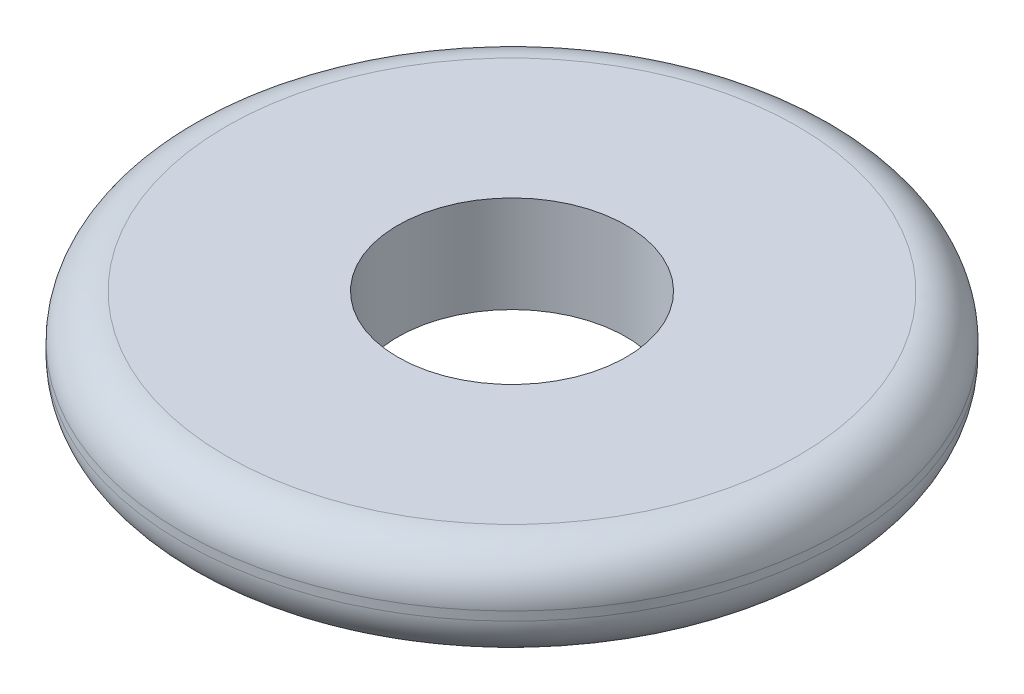
ISO-10303-21;
HEADER;
FILE_DESCRIPTION(('STEP AP214'),'2;1');
FILE_NAME('part.step','',(''),(''),'','','');
FILE_SCHEMA(('AUTOMOTIVE_DESIGN { 1 0 10303 214 1 1 1 1 }'));
ENDSEC;
DATA;
#1=APPLICATION_CONTEXT('core data for automotive mechanical design processes');
#2=APPLICATION_PROTOCOL_DEFINITION('international standard','automotive_design',2000,#1);
#3=PRODUCT_CONTEXT('',#1,'mechanical');
#4=PRODUCT('Part','Part','',(#3));
#5=PRODUCT_RELATED_PRODUCT_CATEGORY('part','',(#4));
#6=PRODUCT_DEFINITION_FORMATION('','',#4);
#7=PRODUCT_DEFINITION_CONTEXT('part definition',#1,'design');
#8=PRODUCT_DEFINITION('design','',#6,#7);
#9=PRODUCT_DEFINITION_SHAPE('','',#8);
#10=(LENGTH_UNIT() NAMED_UNIT(*) SI_UNIT(.MILLI.,.METRE.));
#11=(NAMED_UNIT(*) PLANE_ANGLE_UNIT() SI_UNIT($,.RADIAN.));
#12=(NAMED_UNIT(*) SI_UNIT($,.STERADIAN.) SOLID_ANGLE_UNIT());
#13=UNCERTAINTY_MEASURE_WITH_UNIT(LENGTH_MEASURE(1.E-05),#10,'distance_accuracy_value','');
#14=(GEOMETRIC_REPRESENTATION_CONTEXT(3) GLOBAL_UNCERTAINTY_ASSIGNED_CONTEXT((#13)) GLOBAL_UNIT_ASSIGNED_CONTEXT((#10,
#11,#12)) REPRESENTATION_CONTEXT('',''));
#15=CARTESIAN_POINT('',(0.,0.,0.));
#16=DIRECTION('',(0.,0.,1.));
#17=DIRECTION('',(1.,0.,0.));
#18=AXIS2_PLACEMENT_3D('',#15,#16,#17);
#19=CARTESIAN_POINT('',(0.,1.1,0.));
#20=DIRECTION('',(0.,-1.,0.));
#21=DIRECTION('',(0.,0.,-1.));
#22=AXIS2_PLACEMENT_3D('',#19,#20,#21);
#23=CYLINDRICAL_SURFACE('',#22,3.75);
#24=CARTESIAN_POINT('',(0.,0.5,0.));
#25=DIRECTION('',(0.,1.,0.));
#26=DIRECTION('',(0.,0.,1.));
#27=AXIS2_PLACEMENT_3D('',#24,#25,#26);
#28=CIRCLE('',#27,3.75);
#29=CARTESIAN_POINT('',(0.,0.5,3.75));
#30=VERTEX_POINT('',#29);
#31=EDGE_CURVE('E41',#30,#30,#28,.T.);
#32=ORIENTED_EDGE('',*,*,#31,.T.);
#33=EDGE_LOOP('',(#32));
#34=FACE_BOUND('',#33,.T.);
#35=CARTESIAN_POINT('',(0.,0.6,0.));
#36=DIRECTION('',(0.,1.,0.));
#37=DIRECTION('',(0.,0.,1.));
#38=AXIS2_PLACEMENT_3D('',#35,#36,#37);
#39=CIRCLE('',#38,3.75);
#40=CARTESIAN_POINT('',(0.,0.6,3.75));
#41=VERTEX_POINT('',#40);
#42=EDGE_CURVE('E45',#41,#41,#39,.F.);
#43=ORIENTED_EDGE('',*,*,#42,.T.);
#44=EDGE_LOOP('',(#43));
#45=FACE_BOUND('',#44,.T.);
#46=ADVANCED_FACE('F30',(#34,#45),#23,.T.);
#47=CARTESIAN_POINT('',(0.,1.1,0.));
#48=DIRECTION('',(0.,1.,0.));
#49=DIRECTION('',(0.,0.,1.));
#50=AXIS2_PLACEMENT_3D('',#47,#48,#49);
#51=PLANE('',#50);
#52=CARTESIAN_POINT('',(0.,1.1,0.));
#53=DIRECTION('',(0.,1.,0.));
#54=DIRECTION('',(0.,0.,1.));
#55=AXIS2_PLACEMENT_3D('',#52,#53,#54);
#56=CIRCLE('',#55,3.25);
#57=CARTESIAN_POINT('',(0.,1.1,3.25));
#58=VERTEX_POINT('',#57);
#59=EDGE_CURVE('E10',#58,#58,#56,.T.);
#60=ORIENTED_EDGE('',*,*,#59,.T.);
#61=EDGE_LOOP('',(#60));
#62=FACE_BOUND('',#61,.T.);
#63=CARTESIAN_POINT('',(0.,1.1,0.));
#64=DIRECTION('',(0.,1.,0.));
#65=DIRECTION('',(0.,0.,1.));
#66=AXIS2_PLACEMENT_3D('',#63,#64,#65);
#67=CIRCLE('',#66,1.3);
#68=CARTESIAN_POINT('',(0.,1.1,1.3));
#69=VERTEX_POINT('',#68);
#70=EDGE_CURVE('E51',#69,#69,#67,.T.);
#71=ORIENTED_EDGE('',*,*,#70,.F.);
#72=EDGE_LOOP('',(#71));
#73=FACE_BOUND('',#72,.T.);
#74=ADVANCED_FACE('F66',(#62,#73),#51,.T.);
#75=CARTESIAN_POINT('',(0.,0.,0.));
#76=DIRECTION('',(0.,1.,0.));
#77=DIRECTION('',(0.,0.,1.));
#78=AXIS2_PLACEMENT_3D('',#75,#76,#77);
#79=PLANE('',#78);
#80=CARTESIAN_POINT('',(0.,0.,0.));
#81=DIRECTION('',(0.,1.,0.));
#82=DIRECTION('',(0.,0.,1.));
#83=AXIS2_PLACEMENT_3D('',#80,#81,#82);
#84=CIRCLE('',#83,3.25);
#85=CARTESIAN_POINT('',(0.,0.,3.25));
#86=VERTEX_POINT('',#85);
#87=EDGE_CURVE('E37',#86,#86,#84,.F.);
#88=ORIENTED_EDGE('',*,*,#87,.T.);
#89=EDGE_LOOP('',(#88));
#90=FACE_BOUND('',#89,.T.);
#91=CARTESIAN_POINT('',(0.,0.,0.));
#92=DIRECTION('',(0.,1.,0.));
#93=DIRECTION('',(0.,0.,1.));
#94=AXIS2_PLACEMENT_3D('',#91,#92,#93);
#95=CIRCLE('',#94,1.3);
#96=CARTESIAN_POINT('',(0.,0.,1.3));
#97=VERTEX_POINT('',#96);
#98=EDGE_CURVE('E50',#97,#97,#95,.T.);
#99=ORIENTED_EDGE('',*,*,#98,.T.);
#100=EDGE_LOOP('',(#99));
#101=FACE_BOUND('',#100,.T.);
#102=ADVANCED_FACE('F57',(#90,#101),#79,.F.);
#103=CARTESIAN_POINT('',(0.,0.,0.));
#104=DIRECTION('',(0.,1.,0.));
#105=DIRECTION('',(0.,0.,1.));
#106=AXIS2_PLACEMENT_3D('',#103,#104,#105);
#107=CYLINDRICAL_SURFACE('',#106,1.3);
#108=ORIENTED_EDGE('',*,*,#98,.F.);
#109=EDGE_LOOP('',(#108));
#110=FACE_BOUND('',#109,.T.);
#111=ORIENTED_EDGE('',*,*,#70,.T.);
#112=EDGE_LOOP('',(#111));
#113=FACE_BOUND('',#112,.T.);
#114=ADVANCED_FACE('F59',(#110,#113),#107,.F.);
#115=CARTESIAN_POINT('',(0.,0.5,0.));
#116=DIRECTION('',(0.,1.,0.));
#117=DIRECTION('',(0.,0.,1.));
#118=AXIS2_PLACEMENT_3D('',#115,#116,#117);
#119=TOROIDAL_SURFACE('',#118,3.25,0.5);
#120=ORIENTED_EDGE('',*,*,#87,.F.);
#121=EDGE_LOOP('',(#120));
#122=FACE_BOUND('',#121,.T.);
#123=ORIENTED_EDGE('',*,*,#31,.F.);
#124=EDGE_LOOP('',(#123));
#125=FACE_BOUND('',#124,.T.);
#126=ADVANCED_FACE('F62',(#122,#125),#119,.T.);
#127=CARTESIAN_POINT('',(0.,0.6,0.));
#128=DIRECTION('',(0.,1.,0.));
#129=DIRECTION('',(0.,0.,1.));
#130=AXIS2_PLACEMENT_3D('',#127,#128,#129);
#131=TOROIDAL_SURFACE('',#130,3.25,0.5);
#132=ORIENTED_EDGE('',*,*,#42,.F.);
#133=EDGE_LOOP('',(#132));
#134=FACE_BOUND('',#133,.T.);
#135=ORIENTED_EDGE('',*,*,#59,.F.);
#136=EDGE_LOOP('',(#135));
#137=FACE_BOUND('',#136,.T.);
#138=ADVANCED_FACE('F32',(#134,#137),#131,.T.);
#139=CLOSED_SHELL('',(#46,#74,#102,#114,#126,#138));
#140=MANIFOLD_SOLID_BREP('B2',#139);
#141=ADVANCED_BREP_SHAPE_REPRESENTATION('',(#18,#140),#14);
#142=SHAPE_DEFINITION_REPRESENTATION(#9,#141);
ENDSEC;
END-ISO-10303-21;
